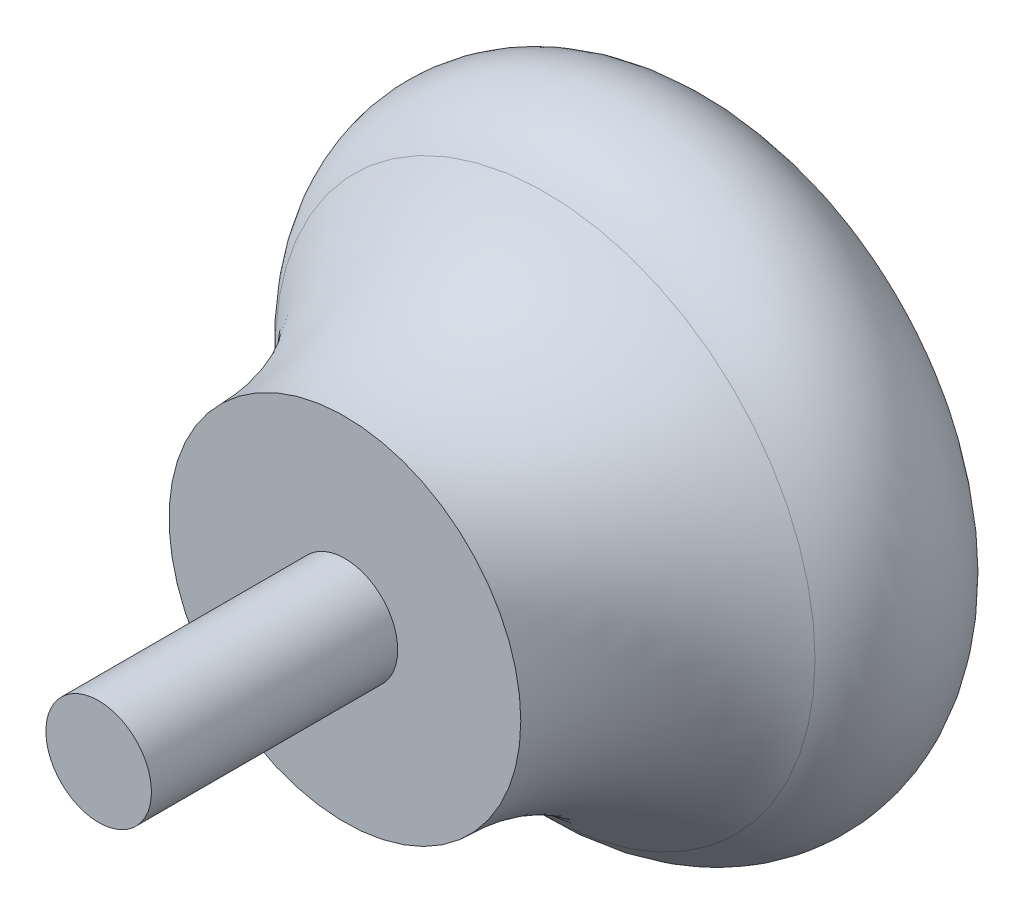
ISO-10303-21;
HEADER;
FILE_DESCRIPTION(('STEP AP214'),'2;1');
FILE_NAME('part.step','',(''),(''),'','','');
FILE_SCHEMA(('AUTOMOTIVE_DESIGN { 1 0 10303 214 1 1 1 1 }'));
ENDSEC;
DATA;
#1=APPLICATION_CONTEXT('core data for automotive mechanical design processes');
#2=APPLICATION_PROTOCOL_DEFINITION('international standard','automotive_design',2000,#1);
#3=PRODUCT_CONTEXT('',#1,'mechanical');
#4=PRODUCT('Part','Part','',(#3));
#5=PRODUCT_RELATED_PRODUCT_CATEGORY('part','',(#4));
#6=PRODUCT_DEFINITION_FORMATION('','',#4);
#7=PRODUCT_DEFINITION_CONTEXT('part definition',#1,'design');
#8=PRODUCT_DEFINITION('design','',#6,#7);
#9=PRODUCT_DEFINITION_SHAPE('','',#8);
#10=(LENGTH_UNIT() NAMED_UNIT(*) SI_UNIT(.MILLI.,.METRE.));
#11=(NAMED_UNIT(*) PLANE_ANGLE_UNIT() SI_UNIT($,.RADIAN.));
#12=(NAMED_UNIT(*) SI_UNIT($,.STERADIAN.) SOLID_ANGLE_UNIT());
#13=UNCERTAINTY_MEASURE_WITH_UNIT(LENGTH_MEASURE(1.E-05),#10,'distance_accuracy_value','');
#14=(GEOMETRIC_REPRESENTATION_CONTEXT(3) GLOBAL_UNCERTAINTY_ASSIGNED_CONTEXT((#13)) GLOBAL_UNIT_ASSIGNED_CONTEXT((#10,
#11,#12)) REPRESENTATION_CONTEXT('',''));
#15=CARTESIAN_POINT('',(0.,0.,0.));
#16=DIRECTION('',(0.,0.,1.));
#17=DIRECTION('',(1.,0.,0.));
#18=AXIS2_PLACEMENT_3D('',#15,#16,#17);
#19=CARTESIAN_POINT('',(0.,0.,0.));
#20=DIRECTION('',(0.,0.,1.));
#21=DIRECTION('',(1.,0.,0.));
#22=AXIS2_PLACEMENT_3D('',#19,#20,#21);
#23=PLANE('',#22);
#24=CARTESIAN_POINT('',(0.,0.,0.));
#25=DIRECTION('',(0.,0.,1.));
#26=DIRECTION('',(1.,0.,0.));
#27=AXIS2_PLACEMENT_3D('',#24,#25,#26);
#28=CIRCLE('',#27,5.75470090966554);
#29=CARTESIAN_POINT('',(5.75470090966554,0.,0.));
#30=VERTEX_POINT('',#29);
#31=EDGE_CURVE('E10',#30,#30,#28,.F.);
#32=ORIENTED_EDGE('',*,*,#31,.T.);
#33=EDGE_LOOP('',(#32));
#34=FACE_BOUND('',#33,.T.);
#35=ADVANCED_FACE('F34',(#34),#23,.F.);
#36=CARTESIAN_POINT('',(0.,0.,11.));
#37=DIRECTION('',(0.,0.,1.));
#38=DIRECTION('',(1.,0.,0.));
#39=AXIS2_PLACEMENT_3D('',#36,#37,#38);
#40=PLANE('',#39);
#41=CARTESIAN_POINT('',(0.,0.,11.));
#42=DIRECTION('',(0.,0.,1.));
#43=DIRECTION('',(1.,0.,0.));
#44=AXIS2_PLACEMENT_3D('',#41,#42,#43);
#45=CIRCLE('',#44,1.5);
#46=CARTESIAN_POINT('',(1.5,0.,11.));
#47=VERTEX_POINT('',#46);
#48=EDGE_CURVE('E45',#47,#47,#45,.T.);
#49=ORIENTED_EDGE('',*,*,#48,.F.);
#50=EDGE_LOOP('',(#49));
#51=FACE_BOUND('',#50,.T.);
#52=CARTESIAN_POINT('',(0.,0.,11.));
#53=DIRECTION('',(0.,0.,1.));
#54=DIRECTION('',(1.,0.,0.));
#55=AXIS2_PLACEMENT_3D('',#52,#53,#54);
#56=CIRCLE('',#55,5.);
#57=CARTESIAN_POINT('',(5.,0.,11.));
#58=VERTEX_POINT('',#57);
#59=EDGE_CURVE('E49',#58,#58,#56,.T.);
#60=ORIENTED_EDGE('',*,*,#59,.T.);
#61=EDGE_LOOP('',(#60));
#62=FACE_BOUND('',#61,.T.);
#63=ADVANCED_FACE('F63',(#51,#62),#40,.T.);
#64=CARTESIAN_POINT('',(0.,0.,18.));
#65=DIRECTION('',(0.,0.,-1.));
#66=DIRECTION('',(-1.,0.,0.));
#67=AXIS2_PLACEMENT_3D('',#64,#65,#66);
#68=CYLINDRICAL_SURFACE('',#67,1.5);
#69=CARTESIAN_POINT('',(0.,0.,18.));
#70=DIRECTION('',(0.,0.,1.));
#71=DIRECTION('',(1.,0.,0.));
#72=AXIS2_PLACEMENT_3D('',#69,#70,#71);
#73=CIRCLE('',#72,1.5);
#74=CARTESIAN_POINT('',(1.5,0.,18.));
#75=VERTEX_POINT('',#74);
#76=EDGE_CURVE('E53',#75,#75,#73,.T.);
#77=ORIENTED_EDGE('',*,*,#76,.F.);
#78=EDGE_LOOP('',(#77));
#79=FACE_BOUND('',#78,.T.);
#80=ORIENTED_EDGE('',*,*,#48,.T.);
#81=EDGE_LOOP('',(#80));
#82=FACE_BOUND('',#81,.T.);
#83=ADVANCED_FACE('F60',(#79,#82),#68,.T.);
#84=CARTESIAN_POINT('',(0.,0.,18.));
#85=DIRECTION('',(0.,0.,1.));
#86=DIRECTION('',(1.,0.,0.));
#87=AXIS2_PLACEMENT_3D('',#84,#85,#86);
#88=PLANE('',#87);
#89=ORIENTED_EDGE('',*,*,#76,.T.);
#90=EDGE_LOOP('',(#89));
#91=FACE_BOUND('',#90,.T.);
#92=ADVANCED_FACE('F58',(#91),#88,.T.);
#93=CARTESIAN_POINT('',(0.,0.,11.));
#94=DIRECTION('',(0.,0.,-1.));
#95=DIRECTION('',(-1.,0.,0.));
#96=AXIS2_PLACEMENT_3D('',#93,#94,#95);
#97=TOROIDAL_SURFACE('',#96,12.4,7.4);
#98=CARTESIAN_POINT('',(0.,0.,5.30769230769231));
#99=DIRECTION('',(0.,0.,1.));
#100=DIRECTION('',(1.,0.,0.));
#101=AXIS2_PLACEMENT_3D('',#98,#99,#100);
#102=CIRCLE('',#101,7.67161410880048);
#103=CARTESIAN_POINT('',(7.67161410880048,0.,5.30769230769231));
#104=VERTEX_POINT('',#103);
#105=EDGE_CURVE('E41',#104,#104,#102,.T.);
#106=ORIENTED_EDGE('',*,*,#105,.T.);
#107=EDGE_LOOP('',(#106));
#108=FACE_BOUND('',#107,.T.);
#109=ORIENTED_EDGE('',*,*,#59,.F.);
#110=EDGE_LOOP('',(#109));
#111=FACE_BOUND('',#110,.T.);
#112=ADVANCED_FACE('F72',(#108,#111),#97,.F.);
#113=CARTESIAN_POINT('',(0.,0.,3.));
#114=DIRECTION('',(0.,0.,-1.));
#115=DIRECTION('',(-1.,0.,0.));
#116=AXIS2_PLACEMENT_3D('',#113,#114,#115);
#117=TOROIDAL_SURFACE('',#116,5.75470090966554,3.);
#118=ORIENTED_EDGE('',*,*,#31,.F.);
#119=EDGE_LOOP('',(#118));
#120=FACE_BOUND('',#119,.T.);
#121=ORIENTED_EDGE('',*,*,#105,.F.);
#122=EDGE_LOOP('',(#121));
#123=FACE_BOUND('',#122,.T.);
#124=ADVANCED_FACE('F36',(#120,#123),#117,.T.);
#125=CLOSED_SHELL('',(#35,#63,#83,#92,#112,#124));
#126=MANIFOLD_SOLID_BREP('B2',#125);
#127=ADVANCED_BREP_SHAPE_REPRESENTATION('',(#18,#126),#14);
#128=SHAPE_DEFINITION_REPRESENTATION(#9,#127);
ENDSEC;
END-ISO-10303-21;
